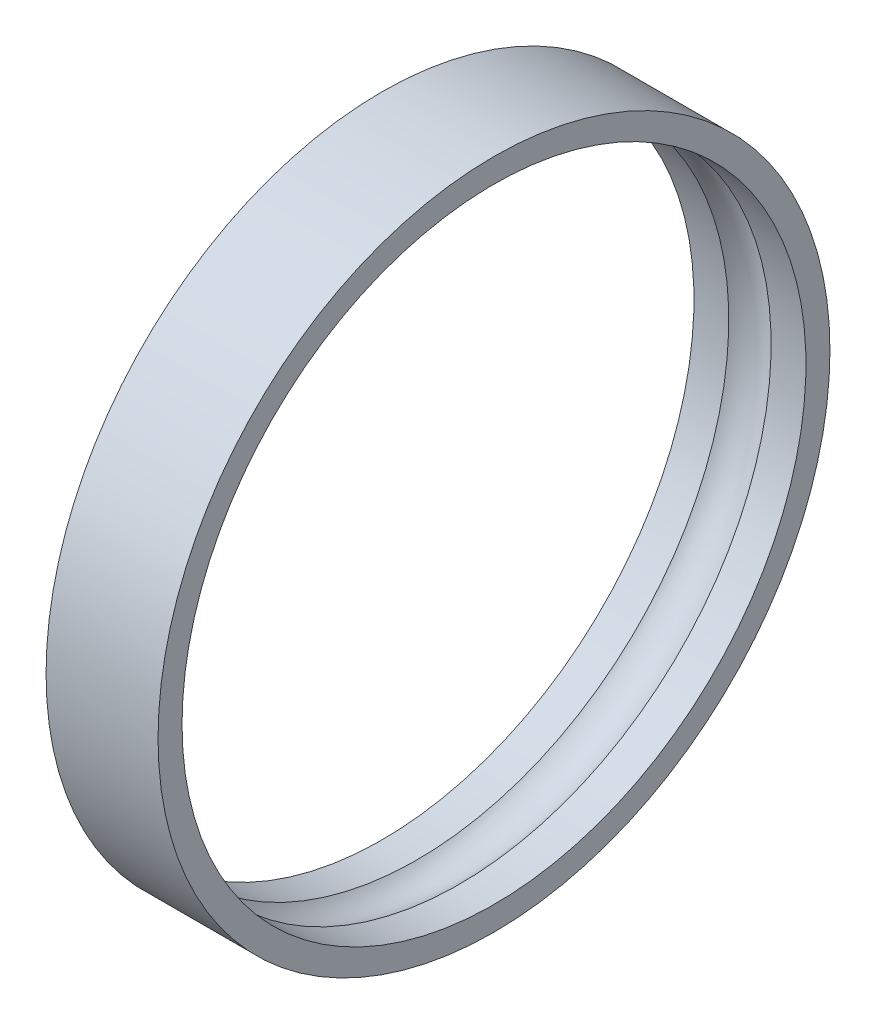
ISO-10303-21;
HEADER;
FILE_DESCRIPTION(('STEP AP214'),'2;1');
FILE_NAME('part.step','',(''),(''),'','','');
FILE_SCHEMA(('AUTOMOTIVE_DESIGN { 1 0 10303 214 1 1 1 1 }'));
ENDSEC;
DATA;
#1=APPLICATION_CONTEXT('core data for automotive mechanical design processes');
#2=APPLICATION_PROTOCOL_DEFINITION('international standard','automotive_design',2000,#1);
#3=PRODUCT_CONTEXT('',#1,'mechanical');
#4=PRODUCT('Part','Part','',(#3));
#5=PRODUCT_RELATED_PRODUCT_CATEGORY('part','',(#4));
#6=PRODUCT_DEFINITION_FORMATION('','',#4);
#7=PRODUCT_DEFINITION_CONTEXT('part definition',#1,'design');
#8=PRODUCT_DEFINITION('design','',#6,#7);
#9=PRODUCT_DEFINITION_SHAPE('','',#8);
#10=(LENGTH_UNIT() NAMED_UNIT(*) SI_UNIT(.MILLI.,.METRE.));
#11=(NAMED_UNIT(*) PLANE_ANGLE_UNIT() SI_UNIT($,.RADIAN.));
#12=(NAMED_UNIT(*) SI_UNIT($,.STERADIAN.) SOLID_ANGLE_UNIT());
#13=UNCERTAINTY_MEASURE_WITH_UNIT(LENGTH_MEASURE(1.E-05),#10,'distance_accuracy_value','');
#14=(GEOMETRIC_REPRESENTATION_CONTEXT(3) GLOBAL_UNCERTAINTY_ASSIGNED_CONTEXT((#13)) GLOBAL_UNIT_ASSIGNED_CONTEXT((#10,
#11,#12)) REPRESENTATION_CONTEXT('',''));
#15=CARTESIAN_POINT('',(0.,0.,0.));
#16=DIRECTION('',(0.,0.,1.));
#17=DIRECTION('',(1.,0.,0.));
#18=AXIS2_PLACEMENT_3D('',#15,#16,#17);
#19=CARTESIAN_POINT('',(3.5,0.,1.5));
#20=DIRECTION('',(1.,0.,0.));
#21=DIRECTION('',(0.,0.,-1.));
#22=AXIS2_PLACEMENT_3D('',#19,#20,#21);
#23=PLANE('',#22);
#24=CARTESIAN_POINT('',(3.5,0.,-18.));
#25=DIRECTION('',(-1.,0.,0.));
#26=DIRECTION('',(0.,0.,1.));
#27=AXIS2_PLACEMENT_3D('',#24,#25,#26);
#28=CIRCLE('',#27,19.5);
#29=CARTESIAN_POINT('',(3.5,0.,1.5));
#30=VERTEX_POINT('',#29);
#31=EDGE_CURVE('E11',#30,#30,#28,.T.);
#32=ORIENTED_EDGE('',*,*,#31,.T.);
#33=EDGE_LOOP('',(#32));
#34=FACE_BOUND('',#33,.T.);
#35=CARTESIAN_POINT('',(3.5,0.,-18.));
#36=DIRECTION('',(-1.,0.,0.));
#37=DIRECTION('',(0.,0.,1.));
#38=AXIS2_PLACEMENT_3D('',#35,#36,#37);
#39=CIRCLE('',#38,21.);
#40=CARTESIAN_POINT('',(3.5,0.,3.));
#41=VERTEX_POINT('',#40);
#42=EDGE_CURVE('E59',#41,#41,#39,.T.);
#43=ORIENTED_EDGE('',*,*,#42,.F.);
#44=EDGE_LOOP('',(#43));
#45=FACE_BOUND('',#44,.T.);
#46=ADVANCED_FACE('F37',(#34,#45),#23,.T.);
#47=CARTESIAN_POINT('',(0.,0.,-18.));
#48=DIRECTION('',(-1.,0.,0.));
#49=DIRECTION('',(0.,0.,1.));
#50=AXIS2_PLACEMENT_3D('',#47,#48,#49);
#51=CYLINDRICAL_SURFACE('',#50,19.5);
#52=CARTESIAN_POINT('',(1.32287565553229,0.,-18.));
#53=DIRECTION('',(-1.,0.,0.));
#54=DIRECTION('',(0.,0.,1.));
#55=AXIS2_PLACEMENT_3D('',#52,#53,#54);
#56=CIRCLE('',#55,19.5);
#57=CARTESIAN_POINT('',(1.32287565553229,0.,1.5));
#58=VERTEX_POINT('',#57);
#59=EDGE_CURVE('E43',#58,#58,#56,.T.);
#60=ORIENTED_EDGE('',*,*,#59,.T.);
#61=EDGE_LOOP('',(#60));
#62=FACE_BOUND('',#61,.T.);
#63=ORIENTED_EDGE('',*,*,#31,.F.);
#64=EDGE_LOOP('',(#63));
#65=FACE_BOUND('',#64,.T.);
#66=ADVANCED_FACE('F67',(#62,#65),#51,.F.);
#67=CARTESIAN_POINT('',(0.,0.,-18.));
#68=DIRECTION('',(-1.,0.,0.));
#69=DIRECTION('',(0.,0.,1.));
#70=AXIS2_PLACEMENT_3D('',#67,#68,#69);
#71=TOROIDAL_SURFACE('',#70,18.,2.);
#72=CARTESIAN_POINT('',(-1.3228756555323,0.,-18.));
#73=DIRECTION('',(-1.,0.,0.));
#74=DIRECTION('',(0.,0.,1.));
#75=AXIS2_PLACEMENT_3D('',#72,#73,#74);
#76=CIRCLE('',#75,19.5);
#77=CARTESIAN_POINT('',(-1.3228756555323,0.,1.5));
#78=VERTEX_POINT('',#77);
#79=EDGE_CURVE('E47',#78,#78,#76,.T.);
#80=ORIENTED_EDGE('',*,*,#79,.T.);
#81=EDGE_LOOP('',(#80));
#82=FACE_BOUND('',#81,.T.);
#83=ORIENTED_EDGE('',*,*,#59,.F.);
#84=EDGE_LOOP('',(#83));
#85=FACE_BOUND('',#84,.T.);
#86=ADVANCED_FACE('F71',(#82,#85),#71,.F.);
#87=CARTESIAN_POINT('',(0.,0.,-18.));
#88=DIRECTION('',(-1.,0.,0.));
#89=DIRECTION('',(0.,0.,1.));
#90=AXIS2_PLACEMENT_3D('',#87,#88,#89);
#91=CYLINDRICAL_SURFACE('',#90,19.5);
#92=CARTESIAN_POINT('',(-3.5,0.,-18.));
#93=DIRECTION('',(-1.,0.,0.));
#94=DIRECTION('',(0.,0.,1.));
#95=AXIS2_PLACEMENT_3D('',#92,#93,#94);
#96=CIRCLE('',#95,19.5);
#97=CARTESIAN_POINT('',(-3.5,0.,1.5));
#98=VERTEX_POINT('',#97);
#99=EDGE_CURVE('E51',#98,#98,#96,.T.);
#100=ORIENTED_EDGE('',*,*,#99,.T.);
#101=EDGE_LOOP('',(#100));
#102=FACE_BOUND('',#101,.T.);
#103=ORIENTED_EDGE('',*,*,#79,.F.);
#104=EDGE_LOOP('',(#103));
#105=FACE_BOUND('',#104,.T.);
#106=ADVANCED_FACE('F75',(#102,#105),#91,.F.);
#107=CARTESIAN_POINT('',(-3.5,0.,1.5));
#108=DIRECTION('',(-1.,0.,0.));
#109=DIRECTION('',(0.,0.,1.));
#110=AXIS2_PLACEMENT_3D('',#107,#108,#109);
#111=PLANE('',#110);
#112=CARTESIAN_POINT('',(-3.5,0.,-18.));
#113=DIRECTION('',(-1.,0.,0.));
#114=DIRECTION('',(0.,0.,1.));
#115=AXIS2_PLACEMENT_3D('',#112,#113,#114);
#116=CIRCLE('',#115,21.);
#117=CARTESIAN_POINT('',(-3.5,0.,3.));
#118=VERTEX_POINT('',#117);
#119=EDGE_CURVE('E56',#118,#118,#116,.T.);
#120=ORIENTED_EDGE('',*,*,#119,.T.);
#121=EDGE_LOOP('',(#120));
#122=FACE_BOUND('',#121,.T.);
#123=ORIENTED_EDGE('',*,*,#99,.F.);
#124=EDGE_LOOP('',(#123));
#125=FACE_BOUND('',#124,.T.);
#126=ADVANCED_FACE('F82',(#122,#125),#111,.T.);
#127=CARTESIAN_POINT('',(0.,0.,-18.));
#128=DIRECTION('',(-1.,0.,0.));
#129=DIRECTION('',(0.,0.,1.));
#130=AXIS2_PLACEMENT_3D('',#127,#128,#129);
#131=CYLINDRICAL_SURFACE('',#130,21.);
#132=ORIENTED_EDGE('',*,*,#42,.T.);
#133=EDGE_LOOP('',(#132));
#134=FACE_BOUND('',#133,.T.);
#135=ORIENTED_EDGE('',*,*,#119,.F.);
#136=EDGE_LOOP('',(#135));
#137=FACE_BOUND('',#136,.T.);
#138=ADVANCED_FACE('F63',(#134,#137),#131,.T.);
#139=CLOSED_SHELL('',(#46,#66,#86,#106,#126,#138));
#140=MANIFOLD_SOLID_BREP('B2',#139);
#141=ADVANCED_BREP_SHAPE_REPRESENTATION('',(#18,#140),#14);
#142=SHAPE_DEFINITION_REPRESENTATION(#9,#141);
ENDSEC;
END-ISO-10303-21;
